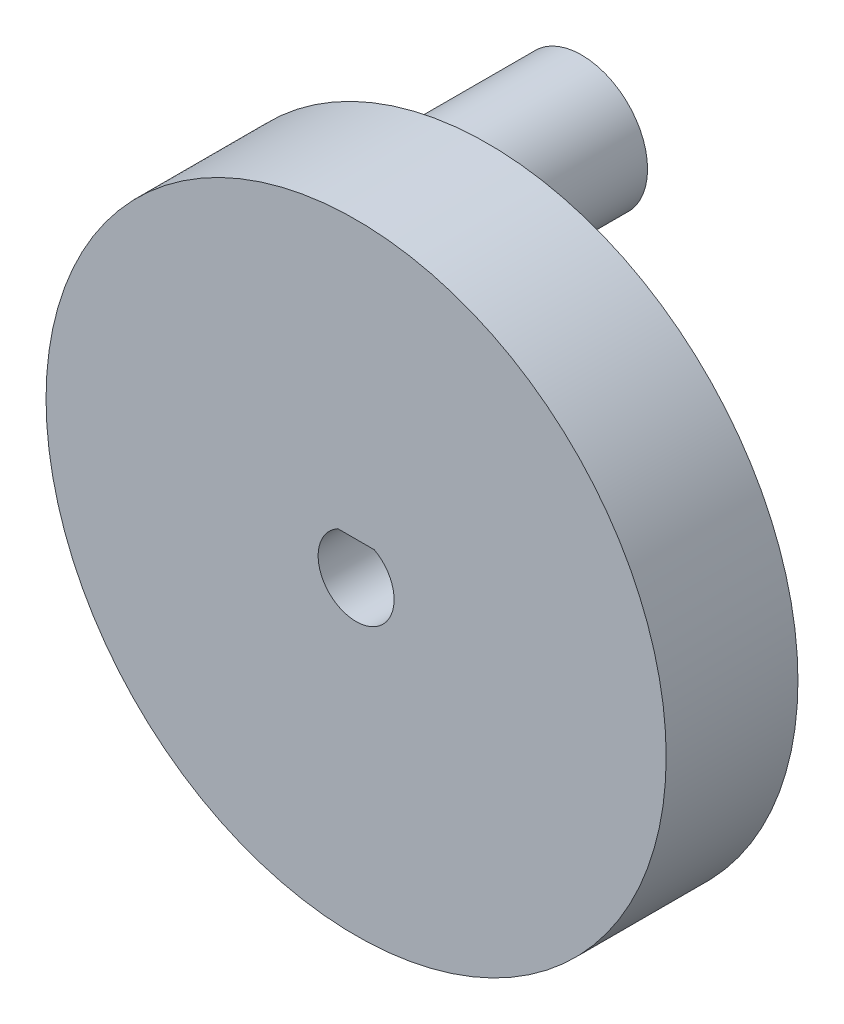
ISO-10303-21;
HEADER;
FILE_DESCRIPTION(('STEP AP214'),'2;1');
FILE_NAME('part.step','',(''),(''),'','','');
FILE_SCHEMA(('AUTOMOTIVE_DESIGN { 1 0 10303 214 1 1 1 1 }'));
ENDSEC;
DATA;
#1=APPLICATION_CONTEXT('core data for automotive mechanical design processes');
#2=APPLICATION_PROTOCOL_DEFINITION('international standard','automotive_design',2000,#1);
#3=PRODUCT_CONTEXT('',#1,'mechanical');
#4=PRODUCT('Part','Part','',(#3));
#5=PRODUCT_RELATED_PRODUCT_CATEGORY('part','',(#4));
#6=PRODUCT_DEFINITION_FORMATION('','',#4);
#7=PRODUCT_DEFINITION_CONTEXT('part definition',#1,'design');
#8=PRODUCT_DEFINITION('design','',#6,#7);
#9=PRODUCT_DEFINITION_SHAPE('','',#8);
#10=(LENGTH_UNIT() NAMED_UNIT(*) SI_UNIT(.MILLI.,.METRE.));
#11=(NAMED_UNIT(*) PLANE_ANGLE_UNIT() SI_UNIT($,.RADIAN.));
#12=(NAMED_UNIT(*) SI_UNIT($,.STERADIAN.) SOLID_ANGLE_UNIT());
#13=UNCERTAINTY_MEASURE_WITH_UNIT(LENGTH_MEASURE(1.E-05),#10,'distance_accuracy_value','');
#14=(GEOMETRIC_REPRESENTATION_CONTEXT(3) GLOBAL_UNCERTAINTY_ASSIGNED_CONTEXT((#13)) GLOBAL_UNIT_ASSIGNED_CONTEXT((#10,
#11,#12)) REPRESENTATION_CONTEXT('',''));
#15=CARTESIAN_POINT('',(0.,0.,0.));
#16=DIRECTION('',(0.,0.,1.));
#17=DIRECTION('',(1.,0.,0.));
#18=AXIS2_PLACEMENT_3D('',#15,#16,#17);
#19=CARTESIAN_POINT('',(0.,0.,-8.5));
#20=DIRECTION('',(0.,0.,1.));
#21=DIRECTION('',(1.,0.,0.));
#22=AXIS2_PLACEMENT_3D('',#19,#20,#21);
#23=CYLINDRICAL_SURFACE('',#22,20.);
#24=CARTESIAN_POINT('',(0.,0.,-8.5));
#25=DIRECTION('',(0.,0.,1.));
#26=DIRECTION('',(1.,0.,0.));
#27=AXIS2_PLACEMENT_3D('',#24,#25,#26);
#28=CIRCLE('',#27,20.);
#29=CARTESIAN_POINT('',(20.,0.,-8.5));
#30=VERTEX_POINT('',#29);
#31=EDGE_CURVE('E83',#30,#30,#28,.T.);
#32=ORIENTED_EDGE('',*,*,#31,.T.);
#33=EDGE_LOOP('',(#32));
#34=FACE_BOUND('',#33,.T.);
#35=CARTESIAN_POINT('',(0.,0.,0.));
#36=DIRECTION('',(0.,0.,1.));
#37=DIRECTION('',(1.,0.,0.));
#38=AXIS2_PLACEMENT_3D('',#35,#36,#37);
#39=CIRCLE('',#38,20.);
#40=CARTESIAN_POINT('',(20.,0.,0.));
#41=VERTEX_POINT('',#40);
#42=EDGE_CURVE('E63',#41,#41,#39,.T.);
#43=ORIENTED_EDGE('',*,*,#42,.F.);
#44=EDGE_LOOP('',(#43));
#45=FACE_BOUND('',#44,.T.);
#46=ADVANCED_FACE('F32',(#34,#45),#23,.T.);
#47=CARTESIAN_POINT('',(0.,0.,-8.5));
#48=DIRECTION('',(0.,0.,1.));
#49=DIRECTION('',(1.,0.,0.));
#50=AXIS2_PLACEMENT_3D('',#47,#48,#49);
#51=PLANE('',#50);
#52=CARTESIAN_POINT('',(-8.95113150147861,8.72509282719888,-8.5));
#53=DIRECTION('',(0.,0.,1.));
#54=DIRECTION('',(1.,0.,0.));
#55=AXIS2_PLACEMENT_3D('',#52,#53,#54);
#56=CIRCLE('',#55,5.75000000000001);
#57=CARTESIAN_POINT('',(-3.2011315014786,8.72509282719888,-8.5));
#58=VERTEX_POINT('',#57);
#59=EDGE_CURVE('E11',#58,#58,#56,.T.);
#60=ORIENTED_EDGE('',*,*,#59,.T.);
#61=EDGE_LOOP('',(#60));
#62=FACE_BOUND('',#61,.T.);
#63=DIRECTION('',(-1.,0.,0.));
#64=VECTOR('',#63,1.);
#65=CARTESIAN_POINT('',(-1.17473401244707,2.15,-8.5));
#66=LINE('',#65,#64);
#67=CARTESIAN_POINT('',(1.17473401244707,2.15,-8.5));
#68=VERTEX_POINT('',#67);
#69=CARTESIAN_POINT('',(-1.17473401244707,2.15,-8.5));
#70=VERTEX_POINT('',#69);
#71=EDGE_CURVE('E79',#68,#70,#66,.T.);
#72=ORIENTED_EDGE('',*,*,#71,.T.);
#73=CARTESIAN_POINT('',(0.,0.,-8.5));
#74=DIRECTION('',(0.,0.,1.));
#75=DIRECTION('',(1.,0.,0.));
#76=AXIS2_PLACEMENT_3D('',#73,#74,#75);
#77=CIRCLE('',#76,2.45);
#78=EDGE_CURVE('E47',#70,#68,#77,.T.);
#79=ORIENTED_EDGE('',*,*,#78,.T.);
#80=EDGE_LOOP('',(#72,#79));
#81=FACE_BOUND('',#80,.T.);
#82=ORIENTED_EDGE('',*,*,#31,.F.);
#83=EDGE_LOOP('',(#82));
#84=FACE_BOUND('',#83,.T.);
#85=ADVANCED_FACE('F102',(#62,#81,#84),#51,.F.);
#86=CARTESIAN_POINT('',(0.,0.,0.));
#87=DIRECTION('',(0.,0.,1.));
#88=DIRECTION('',(1.,0.,0.));
#89=AXIS2_PLACEMENT_3D('',#86,#87,#88);
#90=PLANE('',#89);
#91=CARTESIAN_POINT('',(0.,0.,0.));
#92=DIRECTION('',(0.,0.,1.));
#93=DIRECTION('',(1.,0.,0.));
#94=AXIS2_PLACEMENT_3D('',#91,#92,#93);
#95=CIRCLE('',#94,2.45);
#96=CARTESIAN_POINT('',(-1.17473401244707,2.15,0.));
#97=VERTEX_POINT('',#96);
#98=CARTESIAN_POINT('',(1.17473401244707,2.15,0.));
#99=VERTEX_POINT('',#98);
#100=EDGE_CURVE('E52',#97,#99,#95,.T.);
#101=ORIENTED_EDGE('',*,*,#100,.F.);
#102=DIRECTION('',(-1.,0.,0.));
#103=VECTOR('',#102,1.);
#104=CARTESIAN_POINT('',(-1.17473401244707,2.15,0.));
#105=LINE('',#104,#103);
#106=EDGE_CURVE('E67',#99,#97,#105,.T.);
#107=ORIENTED_EDGE('',*,*,#106,.F.);
#108=EDGE_LOOP('',(#101,#107));
#109=FACE_BOUND('',#108,.T.);
#110=ORIENTED_EDGE('',*,*,#42,.T.);
#111=EDGE_LOOP('',(#110));
#112=FACE_BOUND('',#111,.T.);
#113=ADVANCED_FACE('F71',(#109,#112),#90,.T.);
#114=CARTESIAN_POINT('',(0.,0.,-8.5));
#115=DIRECTION('',(0.,0.,1.));
#116=DIRECTION('',(1.,0.,0.));
#117=AXIS2_PLACEMENT_3D('',#114,#115,#116);
#118=CYLINDRICAL_SURFACE('',#117,2.45);
#119=ORIENTED_EDGE('',*,*,#100,.T.);
#120=DIRECTION('',(0.,0.,1.));
#121=VECTOR('',#120,1.);
#122=CARTESIAN_POINT('',(1.17473401244707,2.15,-8.5));
#123=LINE('',#122,#121);
#124=EDGE_CURVE('E64',#68,#99,#123,.T.);
#125=ORIENTED_EDGE('',*,*,#124,.F.);
#126=ORIENTED_EDGE('',*,*,#78,.F.);
#127=DIRECTION('',(0.,0.,1.));
#128=VECTOR('',#127,1.);
#129=CARTESIAN_POINT('',(-1.17473401244707,2.15,-8.5));
#130=LINE('',#129,#128);
#131=EDGE_CURVE('E57',#70,#97,#130,.T.);
#132=ORIENTED_EDGE('',*,*,#131,.T.);
#133=EDGE_LOOP('',(#119,#125,#126,#132));
#134=FACE_BOUND('',#133,.T.);
#135=ADVANCED_FACE('F59',(#134),#118,.F.);
#136=CARTESIAN_POINT('',(-1.17473401244707,2.15,-8.5));
#137=DIRECTION('',(0.,1.,0.));
#138=DIRECTION('',(-1.,0.,0.));
#139=AXIS2_PLACEMENT_3D('',#136,#137,#138);
#140=PLANE('',#139);
#141=ORIENTED_EDGE('',*,*,#106,.T.);
#142=ORIENTED_EDGE('',*,*,#131,.F.);
#143=ORIENTED_EDGE('',*,*,#71,.F.);
#144=ORIENTED_EDGE('',*,*,#124,.T.);
#145=EDGE_LOOP('',(#141,#142,#143,#144));
#146=FACE_BOUND('',#145,.T.);
#147=ADVANCED_FACE('F68',(#146),#140,.F.);
#148=CARTESIAN_POINT('',(-8.95113150147861,8.72509282719888,-23.5));
#149=DIRECTION('',(0.,0.,-1.));
#150=DIRECTION('',(-1.,0.,0.));
#151=AXIS2_PLACEMENT_3D('',#148,#149,#150);
#152=PLANE('',#151);
#153=CARTESIAN_POINT('',(-8.95113150147861,8.72509282719888,-23.5));
#154=DIRECTION('',(0.,0.,-1.));
#155=DIRECTION('',(-1.,0.,0.));
#156=AXIS2_PLACEMENT_3D('',#153,#154,#155);
#157=CIRCLE('',#156,4.25);
#158=CARTESIAN_POINT('',(-13.2011315014786,8.72509282719888,-23.5));
#159=VERTEX_POINT('',#158);
#160=EDGE_CURVE('E73',#159,#159,#157,.T.);
#161=ORIENTED_EDGE('',*,*,#160,.T.);
#162=EDGE_LOOP('',(#161));
#163=FACE_BOUND('',#162,.T.);
#164=CARTESIAN_POINT('',(-8.95113150147861,8.72509282719888,-23.5));
#165=DIRECTION('',(0.,0.,-1.));
#166=DIRECTION('',(-1.,0.,0.));
#167=AXIS2_PLACEMENT_3D('',#164,#165,#166);
#168=CIRCLE('',#167,1.5);
#169=CARTESIAN_POINT('',(-10.4511315014786,8.72509282719888,-23.5));
#170=VERTEX_POINT('',#169);
#171=EDGE_CURVE('E76',#170,#170,#168,.T.);
#172=ORIENTED_EDGE('',*,*,#171,.F.);
#173=EDGE_LOOP('',(#172));
#174=FACE_BOUND('',#173,.T.);
#175=ADVANCED_FACE('F118',(#163,#174),#152,.T.);
#176=CARTESIAN_POINT('',(-8.95113150147861,8.72509282719888,-23.5));
#177=DIRECTION('',(0.,0.,1.));
#178=DIRECTION('',(1.,0.,0.));
#179=AXIS2_PLACEMENT_3D('',#176,#177,#178);
#180=CYLINDRICAL_SURFACE('',#179,4.25);
#181=CARTESIAN_POINT('',(-8.95113150147861,8.72509282719888,-9.75864944676594));
#182=DIRECTION('',(0.,0.,1.));
#183=DIRECTION('',(1.,0.,0.));
#184=AXIS2_PLACEMENT_3D('',#181,#182,#183);
#185=CIRCLE('',#184,4.25);
#186=CARTESIAN_POINT('',(-4.70113150147861,8.72509282719888,-9.75864944676594));
#187=VERTEX_POINT('',#186);
#188=EDGE_CURVE('E40',#187,#187,#185,.F.);
#189=ORIENTED_EDGE('',*,*,#188,.T.);
#190=EDGE_LOOP('',(#189));
#191=FACE_BOUND('',#190,.T.);
#192=ORIENTED_EDGE('',*,*,#160,.F.);
#193=EDGE_LOOP('',(#192));
#194=FACE_BOUND('',#193,.T.);
#195=ADVANCED_FACE('F90',(#191,#194),#180,.T.);
#196=CARTESIAN_POINT('',(-8.95113150147861,8.72509282719888,-23.5));
#197=DIRECTION('',(0.,0.,1.));
#198=DIRECTION('',(1.,0.,0.));
#199=AXIS2_PLACEMENT_3D('',#196,#197,#198);
#200=CYLINDRICAL_SURFACE('',#199,1.5);
#201=ORIENTED_EDGE('',*,*,#171,.T.);
#202=EDGE_LOOP('',(#201));
#203=FACE_BOUND('',#202,.T.);
#204=CARTESIAN_POINT('',(-8.95113150147861,8.72509282719888,-8.5));
#205=DIRECTION('',(0.,0.,-1.));
#206=DIRECTION('',(-1.,0.,0.));
#207=AXIS2_PLACEMENT_3D('',#204,#205,#206);
#208=CIRCLE('',#207,1.5);
#209=CARTESIAN_POINT('',(-10.4511315014786,8.72509282719888,-8.5));
#210=VERTEX_POINT('',#209);
#211=EDGE_CURVE('E133',#210,#210,#208,.T.);
#212=ORIENTED_EDGE('',*,*,#211,.F.);
#213=EDGE_LOOP('',(#212));
#214=FACE_BOUND('',#213,.T.);
#215=ADVANCED_FACE('F99',(#203,#214),#200,.F.);
#216=ORIENTED_EDGE('',*,*,#211,.T.);
#217=EDGE_LOOP('',(#216));
#218=FACE_BOUND('',#217,.T.);
#219=ADVANCED_FACE('F94',(#218),#51,.F.);
#220=CARTESIAN_POINT('',(-8.95113150147861,8.72509282719888,-9.75864944676594));
#221=DIRECTION('',(0.,0.,1.));
#222=DIRECTION('',(1.,0.,0.));
#223=AXIS2_PLACEMENT_3D('',#220,#221,#222);
#224=CONICAL_SURFACE('',#223,4.25,0.872664625997162);
#225=ORIENTED_EDGE('',*,*,#59,.F.);
#226=EDGE_LOOP('',(#225));
#227=FACE_BOUND('',#226,.T.);
#228=ORIENTED_EDGE('',*,*,#188,.F.);
#229=EDGE_LOOP('',(#228));
#230=FACE_BOUND('',#229,.T.);
#231=ADVANCED_FACE('F34',(#227,#230),#224,.T.);
#232=CLOSED_SHELL('',(#46,#85,#113,#135,#147,#175,#195,#215,#219,#231));
#233=MANIFOLD_SOLID_BREP('B2',#232);
#234=ADVANCED_BREP_SHAPE_REPRESENTATION('',(#18,#233),#14);
#235=SHAPE_DEFINITION_REPRESENTATION(#9,#234);
ENDSEC;
END-ISO-10303-21;
